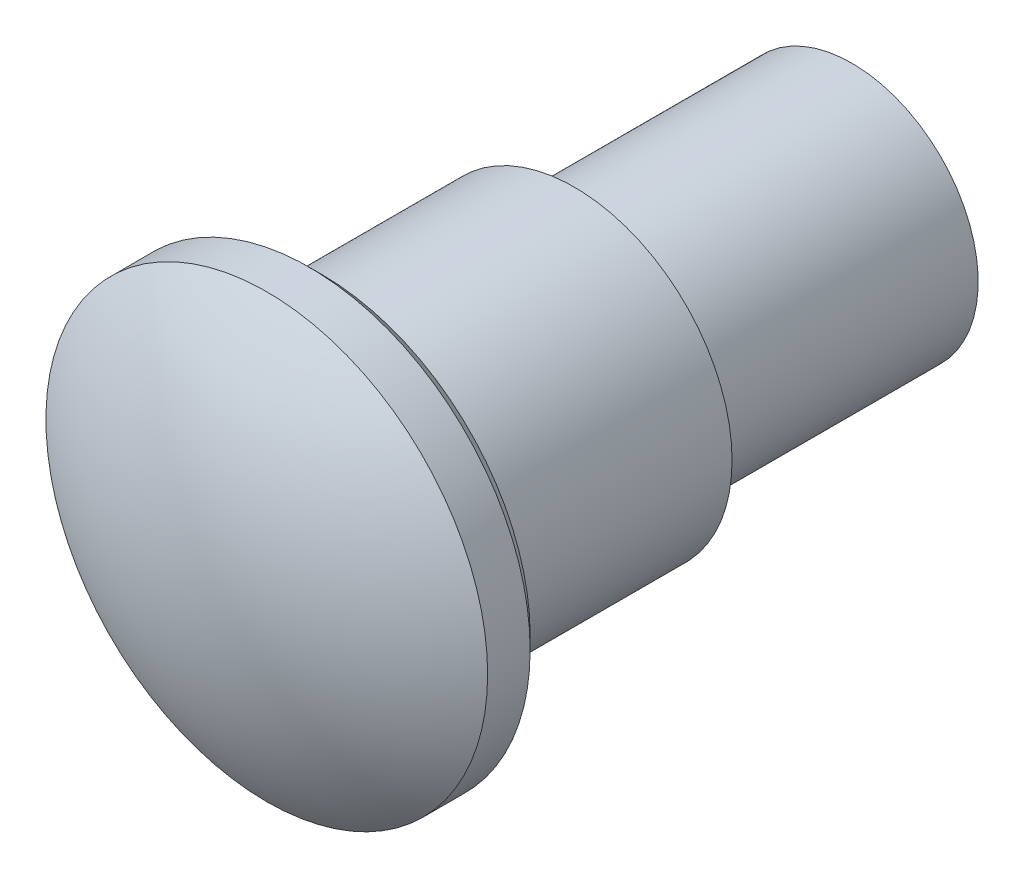
ISO-10303-21;
HEADER;
FILE_DESCRIPTION(('STEP AP214'),'2;1');
FILE_NAME('part.step','',(''),(''),'','','');
FILE_SCHEMA(('AUTOMOTIVE_DESIGN { 1 0 10303 214 1 1 1 1 }'));
ENDSEC;
DATA;
#1=APPLICATION_CONTEXT('core data for automotive mechanical design processes');
#2=APPLICATION_PROTOCOL_DEFINITION('international standard','automotive_design',2000,#1);
#3=PRODUCT_CONTEXT('',#1,'mechanical');
#4=PRODUCT('Part','Part','',(#3));
#5=PRODUCT_RELATED_PRODUCT_CATEGORY('part','',(#4));
#6=PRODUCT_DEFINITION_FORMATION('','',#4);
#7=PRODUCT_DEFINITION_CONTEXT('part definition',#1,'design');
#8=PRODUCT_DEFINITION('design','',#6,#7);
#9=PRODUCT_DEFINITION_SHAPE('','',#8);
#10=(LENGTH_UNIT() NAMED_UNIT(*) SI_UNIT(.MILLI.,.METRE.));
#11=(NAMED_UNIT(*) PLANE_ANGLE_UNIT() SI_UNIT($,.RADIAN.));
#12=(NAMED_UNIT(*) SI_UNIT($,.STERADIAN.) SOLID_ANGLE_UNIT());
#13=UNCERTAINTY_MEASURE_WITH_UNIT(LENGTH_MEASURE(1.E-05),#10,'distance_accuracy_value','');
#14=(GEOMETRIC_REPRESENTATION_CONTEXT(3) GLOBAL_UNCERTAINTY_ASSIGNED_CONTEXT((#13)) GLOBAL_UNIT_ASSIGNED_CONTEXT((#10,
#11,#12)) REPRESENTATION_CONTEXT('',''));
#15=CARTESIAN_POINT('',(0.,0.,0.));
#16=DIRECTION('',(0.,0.,1.));
#17=DIRECTION('',(1.,0.,0.));
#18=AXIS2_PLACEMENT_3D('',#15,#16,#17);
#19=CARTESIAN_POINT('',(0.,0.,-3.));
#20=DIRECTION('',(0.,0.,-1.));
#21=DIRECTION('',(-1.,0.,0.));
#22=AXIS2_PLACEMENT_3D('',#19,#20,#21);
#23=PLANE('',#22);
#24=CARTESIAN_POINT('',(0.,0.,-3.));
#25=DIRECTION('',(0.,0.,-1.));
#26=DIRECTION('',(-1.,0.,0.));
#27=AXIS2_PLACEMENT_3D('',#24,#25,#26);
#28=CIRCLE('',#27,1.);
#29=CARTESIAN_POINT('',(-1.,0.,-3.));
#30=VERTEX_POINT('',#29);
#31=EDGE_CURVE('E84',#30,#30,#28,.T.);
#32=ORIENTED_EDGE('',*,*,#31,.F.);
#33=EDGE_LOOP('',(#32));
#34=FACE_BOUND('',#33,.T.);
#35=CARTESIAN_POINT('',(0.,0.,-3.));
#36=DIRECTION('',(0.,0.,-1.));
#37=DIRECTION('',(-1.,0.,0.));
#38=AXIS2_PLACEMENT_3D('',#35,#36,#37);
#39=CIRCLE('',#38,1.25);
#40=CARTESIAN_POINT('',(-1.25,0.,-3.));
#41=VERTEX_POINT('',#40);
#42=EDGE_CURVE('E75',#41,#41,#39,.T.);
#43=ORIENTED_EDGE('',*,*,#42,.T.);
#44=EDGE_LOOP('',(#43));
#45=FACE_BOUND('',#44,.T.);
#46=ADVANCED_FACE('F53',(#34,#45),#23,.T.);
#47=CARTESIAN_POINT('',(0.,0.,-3.));
#48=DIRECTION('',(0.,0.,-1.));
#49=DIRECTION('',(-1.,0.,0.));
#50=AXIS2_PLACEMENT_3D('',#47,#48,#49);
#51=CYLINDRICAL_SURFACE('',#50,1.);
#52=ORIENTED_EDGE('',*,*,#31,.T.);
#53=EDGE_LOOP('',(#52));
#54=FACE_BOUND('',#53,.T.);
#55=CARTESIAN_POINT('',(0.,0.,-5.2));
#56=DIRECTION('',(0.,0.,-1.));
#57=DIRECTION('',(-1.,0.,0.));
#58=AXIS2_PLACEMENT_3D('',#55,#56,#57);
#59=CIRCLE('',#58,1.);
#60=CARTESIAN_POINT('',(-1.,0.,-5.2));
#61=VERTEX_POINT('',#60);
#62=EDGE_CURVE('E82',#61,#61,#59,.T.);
#63=ORIENTED_EDGE('',*,*,#62,.F.);
#64=EDGE_LOOP('',(#63));
#65=FACE_BOUND('',#64,.T.);
#66=ADVANCED_FACE('F105',(#54,#65),#51,.T.);
#67=CARTESIAN_POINT('',(0.,0.,-5.2));
#68=DIRECTION('',(0.,0.,1.));
#69=DIRECTION('',(1.,0.,0.));
#70=AXIS2_PLACEMENT_3D('',#67,#68,#69);
#71=PLANE('',#70);
#72=CARTESIAN_POINT('',(0.,0.,-5.2));
#73=DIRECTION('',(0.,0.,1.));
#74=DIRECTION('',(1.,0.,0.));
#75=AXIS2_PLACEMENT_3D('',#72,#73,#74);
#76=CIRCLE('',#75,0.8);
#77=CARTESIAN_POINT('',(0.8,0.,-5.2));
#78=VERTEX_POINT('',#77);
#79=EDGE_CURVE('E73',#78,#78,#76,.T.);
#80=ORIENTED_EDGE('',*,*,#79,.T.);
#81=EDGE_LOOP('',(#80));
#82=FACE_BOUND('',#81,.T.);
#83=ORIENTED_EDGE('',*,*,#62,.T.);
#84=EDGE_LOOP('',(#83));
#85=FACE_BOUND('',#84,.T.);
#86=ADVANCED_FACE('F111',(#82,#85),#71,.F.);
#87=CARTESIAN_POINT('',(0.,0.,-1.));
#88=DIRECTION('',(0.,0.,-1.));
#89=DIRECTION('',(-1.,0.,0.));
#90=AXIS2_PLACEMENT_3D('',#87,#88,#89);
#91=PLANE('',#90);
#92=CARTESIAN_POINT('',(0.,0.,-1.));
#93=DIRECTION('',(0.,0.,-1.));
#94=DIRECTION('',(-1.,0.,0.));
#95=AXIS2_PLACEMENT_3D('',#92,#93,#94);
#96=CIRCLE('',#95,1.65);
#97=CARTESIAN_POINT('',(-1.65,0.,-1.));
#98=VERTEX_POINT('',#97);
#99=EDGE_CURVE('E13',#98,#98,#96,.T.);
#100=ORIENTED_EDGE('',*,*,#99,.T.);
#101=EDGE_LOOP('',(#100));
#102=FACE_BOUND('',#101,.T.);
#103=CARTESIAN_POINT('',(0.,0.,-1.));
#104=DIRECTION('',(0.,0.,-1.));
#105=DIRECTION('',(-1.,0.,0.));
#106=AXIS2_PLACEMENT_3D('',#103,#104,#105);
#107=CIRCLE('',#106,1.25);
#108=CARTESIAN_POINT('',(-1.25,0.,-1.));
#109=VERTEX_POINT('',#108);
#110=EDGE_CURVE('E78',#109,#109,#107,.T.);
#111=ORIENTED_EDGE('',*,*,#110,.F.);
#112=EDGE_LOOP('',(#111));
#113=FACE_BOUND('',#112,.T.);
#114=ADVANCED_FACE('F122',(#102,#113),#91,.T.);
#115=CARTESIAN_POINT('',(0.,0.,-1.));
#116=DIRECTION('',(0.,0.,-1.));
#117=DIRECTION('',(-1.,0.,0.));
#118=AXIS2_PLACEMENT_3D('',#115,#116,#117);
#119=CYLINDRICAL_SURFACE('',#118,1.25);
#120=ORIENTED_EDGE('',*,*,#110,.T.);
#121=EDGE_LOOP('',(#120));
#122=FACE_BOUND('',#121,.T.);
#123=ORIENTED_EDGE('',*,*,#42,.F.);
#124=EDGE_LOOP('',(#123));
#125=FACE_BOUND('',#124,.T.);
#126=ADVANCED_FACE('F120',(#122,#125),#119,.T.);
#127=CARTESIAN_POINT('',(0.,0.,-3.));
#128=DIRECTION('',(0.,0.,1.));
#129=DIRECTION('',(0.,-1.,0.));
#130=AXIS2_PLACEMENT_3D('',#127,#128,#129);
#131=SPHERICAL_SURFACE('',#130,3.);
#132=CARTESIAN_POINT('',(0.,0.,0.));
#133=VERTEX_POINT('',#132);
#134=VERTEX_LOOP('',#133);
#135=FACE_BOUND('',#134,.T.);
#136=CARTESIAN_POINT('',(0.,0.,-0.563301413797759));
#137=DIRECTION('',(0.,0.,1.));
#138=DIRECTION('',(1.,0.,0.));
#139=AXIS2_PLACEMENT_3D('',#136,#137,#138);
#140=CIRCLE('',#139,1.75);
#141=CARTESIAN_POINT('',(1.75,0.,-0.563301413797759));
#142=VERTEX_POINT('',#141);
#143=EDGE_CURVE('E87',#142,#142,#140,.T.);
#144=ORIENTED_EDGE('',*,*,#143,.T.);
#145=EDGE_LOOP('',(#144));
#146=FACE_BOUND('',#145,.T.);
#147=ADVANCED_FACE('F102',(#135,#146),#131,.T.);
#148=CARTESIAN_POINT('',(0.,0.,-5.2));
#149=DIRECTION('',(0.,0.,1.));
#150=DIRECTION('',(1.,0.,0.));
#151=AXIS2_PLACEMENT_3D('',#148,#149,#150);
#152=CYLINDRICAL_SURFACE('',#151,1.75);
#153=CARTESIAN_POINT('',(0.,0.,-0.9));
#154=DIRECTION('',(0.,0.,-1.));
#155=DIRECTION('',(-1.,0.,0.));
#156=AXIS2_PLACEMENT_3D('',#153,#154,#155);
#157=CIRCLE('',#156,1.75);
#158=CARTESIAN_POINT('',(-1.75,0.,-0.9));
#159=VERTEX_POINT('',#158);
#160=EDGE_CURVE('E61',#159,#159,#157,.F.);
#161=ORIENTED_EDGE('',*,*,#160,.T.);
#162=EDGE_LOOP('',(#161));
#163=FACE_BOUND('',#162,.T.);
#164=ORIENTED_EDGE('',*,*,#143,.F.);
#165=EDGE_LOOP('',(#164));
#166=FACE_BOUND('',#165,.T.);
#167=ADVANCED_FACE('F94',(#163,#166),#152,.T.);
#168=CARTESIAN_POINT('',(0.,0.,-0.9));
#169=DIRECTION('',(0.,0.,1.));
#170=DIRECTION('',(1.,0.,0.));
#171=AXIS2_PLACEMENT_3D('',#168,#169,#170);
#172=CONICAL_SURFACE('',#171,1.75,0.785398163397454);
#173=ORIENTED_EDGE('',*,*,#99,.F.);
#174=EDGE_LOOP('',(#173));
#175=FACE_BOUND('',#174,.T.);
#176=ORIENTED_EDGE('',*,*,#160,.F.);
#177=EDGE_LOOP('',(#176));
#178=FACE_BOUND('',#177,.T.);
#179=ADVANCED_FACE('F55',(#175,#178),#172,.T.);
#180=CARTESIAN_POINT('',(0.,0.,-5.2));
#181=DIRECTION('',(0.,0.,-1.));
#182=DIRECTION('',(-1.,0.,0.));
#183=AXIS2_PLACEMENT_3D('',#180,#181,#182);
#184=CONICAL_SURFACE('',#183,0.8,0.785398163397448);
#185=CARTESIAN_POINT('',(0.,0.,-4.4));
#186=VERTEX_POINT('',#185);
#187=VERTEX_LOOP('',#186);
#188=FACE_BOUND('',#187,.T.);
#189=ORIENTED_EDGE('',*,*,#79,.F.);
#190=EDGE_LOOP('',(#189));
#191=FACE_BOUND('',#190,.T.);
#192=ADVANCED_FACE('F67',(#188,#191),#184,.F.);
#193=CLOSED_SHELL('',(#46,#66,#86,#114,#126,#147,#167,#179,#192));
#194=MANIFOLD_SOLID_BREP('B2',#193);
#195=ADVANCED_BREP_SHAPE_REPRESENTATION('',(#18,#194),#14);
#196=SHAPE_DEFINITION_REPRESENTATION(#9,#195);
ENDSEC;
END-ISO-10303-21;
